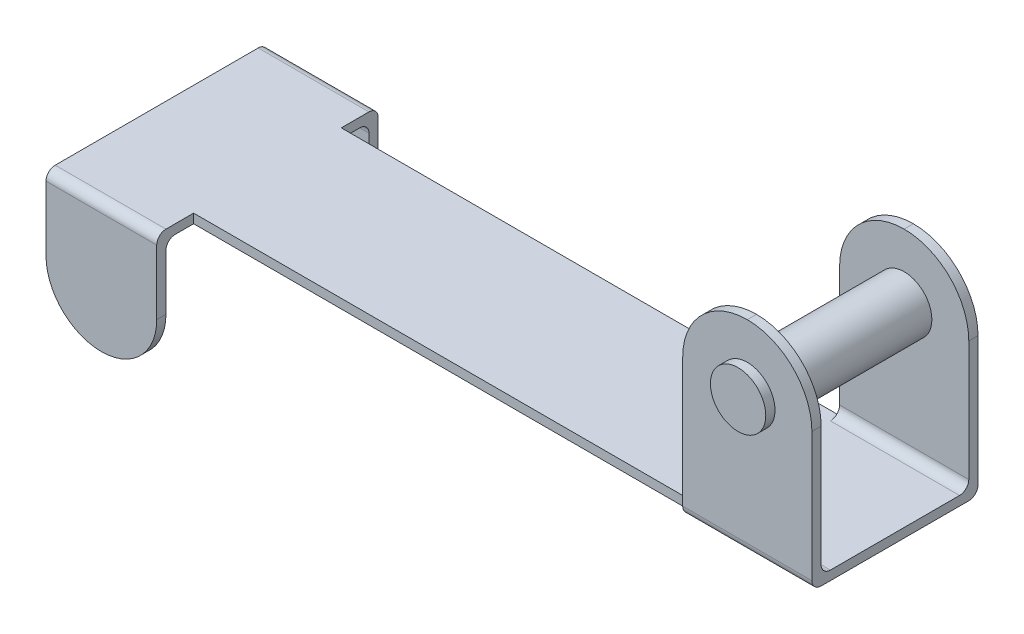
ISO-10303-21;
HEADER;
FILE_DESCRIPTION(('STEP AP214'),'2;1');
FILE_NAME('part.step','',(''),(''),'','','');
FILE_SCHEMA(('AUTOMOTIVE_DESIGN { 1 0 10303 214 1 1 1 1 }'));
ENDSEC;
DATA;
#1=APPLICATION_CONTEXT('core data for automotive mechanical design processes');
#2=APPLICATION_PROTOCOL_DEFINITION('international standard','automotive_design',2000,#1);
#3=PRODUCT_CONTEXT('',#1,'mechanical');
#4=PRODUCT('Part','Part','',(#3));
#5=PRODUCT_RELATED_PRODUCT_CATEGORY('part','',(#4));
#6=PRODUCT_DEFINITION_FORMATION('','',#4);
#7=PRODUCT_DEFINITION_CONTEXT('part definition',#1,'design');
#8=PRODUCT_DEFINITION('design','',#6,#7);
#9=PRODUCT_DEFINITION_SHAPE('','',#8);
#10=(LENGTH_UNIT() NAMED_UNIT(*) SI_UNIT(.MILLI.,.METRE.));
#11=(NAMED_UNIT(*) PLANE_ANGLE_UNIT() SI_UNIT($,.RADIAN.));
#12=(NAMED_UNIT(*) SI_UNIT($,.STERADIAN.) SOLID_ANGLE_UNIT());
#13=UNCERTAINTY_MEASURE_WITH_UNIT(LENGTH_MEASURE(1.E-05),#10,'distance_accuracy_value','');
#14=(GEOMETRIC_REPRESENTATION_CONTEXT(3) GLOBAL_UNCERTAINTY_ASSIGNED_CONTEXT((#13)) GLOBAL_UNIT_ASSIGNED_CONTEXT((#10,
#11,#12)) REPRESENTATION_CONTEXT('',''));
#15=CARTESIAN_POINT('',(0.,0.,0.));
#16=DIRECTION('',(0.,0.,1.));
#17=DIRECTION('',(1.,0.,0.));
#18=AXIS2_PLACEMENT_3D('',#15,#16,#17);
#19=CARTESIAN_POINT('',(0.,0.,2.));
#20=DIRECTION('',(0.,0.,1.));
#21=DIRECTION('',(1.,0.,0.));
#22=AXIS2_PLACEMENT_3D('',#19,#20,#21);
#23=PLANE('',#22);
#24=DIRECTION('',(-1.,0.,0.));
#25=VECTOR('',#24,1.);
#26=CARTESIAN_POINT('',(10.,0.125000000000001,2.));
#27=LINE('',#26,#25);
#28=CARTESIAN_POINT('',(6.5,0.125000000000001,2.));
#29=VERTEX_POINT('',#28);
#30=CARTESIAN_POINT('',(-7.,0.124999999999999,2.));
#31=VERTEX_POINT('',#30);
#32=EDGE_CURVE('E265',#29,#31,#27,.T.);
#33=ORIENTED_EDGE('',*,*,#32,.T.);
#34=DIRECTION('',(0.,-1.,0.));
#35=VECTOR('',#34,1.);
#36=CARTESIAN_POINT('',(-7.,0.124999999999999,2.));
#37=LINE('',#36,#35);
#38=CARTESIAN_POINT('',(-7.,-0.125000000000001,2.));
#39=VERTEX_POINT('',#38);
#40=EDGE_CURVE('E493',#31,#39,#37,.T.);
#41=ORIENTED_EDGE('',*,*,#40,.T.);
#42=DIRECTION('',(1.,0.,0.));
#43=VECTOR('',#42,1.);
#44=CARTESIAN_POINT('',(10.,-0.124999999999999,2.));
#45=LINE('',#44,#43);
#46=CARTESIAN_POINT('',(6.5,-0.124999999999999,2.));
#47=VERTEX_POINT('',#46);
#48=EDGE_CURVE('E263',#39,#47,#45,.T.);
#49=ORIENTED_EDGE('',*,*,#48,.T.);
#50=DIRECTION('',(0.,1.,0.));
#51=VECTOR('',#50,1.);
#52=CARTESIAN_POINT('',(6.5,-0.124999999999999,2.));
#53=LINE('',#52,#51);
#54=EDGE_CURVE('E481',#47,#29,#53,.T.);
#55=ORIENTED_EDGE('',*,*,#54,.T.);
#56=EDGE_LOOP('',(#33,#41,#49,#55));
#57=FACE_BOUND('',#56,.T.);
#58=ADVANCED_FACE('F33',(#57),#23,.T.);
#59=CARTESIAN_POINT('',(-10.,-0.125000000000001,2.));
#60=DIRECTION('',(1.,0.,0.));
#61=DIRECTION('',(0.,0.,-1.));
#62=AXIS2_PLACEMENT_3D('',#59,#60,#61);
#63=PLANE('',#62);
#64=DIRECTION('',(0.,1.,0.));
#65=VECTOR('',#64,1.);
#66=CARTESIAN_POINT('',(-10.,-3.375,3.));
#67=LINE('',#66,#65);
#68=CARTESIAN_POINT('',(-10.,-1.875,3.));
#69=VERTEX_POINT('',#68);
#70=CARTESIAN_POINT('',(-10.,-0.125000000000001,3.));
#71=VERTEX_POINT('',#70);
#72=EDGE_CURVE('E400',#69,#71,#67,.T.);
#73=ORIENTED_EDGE('',*,*,#72,.T.);
#74=CARTESIAN_POINT('',(-10.,-0.125000000000001,2.75));
#75=DIRECTION('',(1.,0.,0.));
#76=DIRECTION('',(0.,0.,-1.));
#77=AXIS2_PLACEMENT_3D('',#74,#75,#76);
#78=CIRCLE('',#77,0.25);
#79=CARTESIAN_POINT('',(-10.,0.124999999999999,2.75));
#80=VERTEX_POINT('',#79);
#81=EDGE_CURVE('E408',#71,#80,#78,.F.);
#82=ORIENTED_EDGE('',*,*,#81,.T.);
#83=DIRECTION('',(0.,0.,-1.));
#84=VECTOR('',#83,1.);
#85=CARTESIAN_POINT('',(-10.,0.124999999999999,2.));
#86=LINE('',#85,#84);
#87=CARTESIAN_POINT('',(-10.,0.124999999999999,-2.75));
#88=VERTEX_POINT('',#87);
#89=EDGE_CURVE('E271',#80,#88,#86,.T.);
#90=ORIENTED_EDGE('',*,*,#89,.T.);
#91=CARTESIAN_POINT('',(-10.,-0.125000000000001,-2.75));
#92=DIRECTION('',(1.,0.,0.));
#93=DIRECTION('',(0.,0.,-1.));
#94=AXIS2_PLACEMENT_3D('',#91,#92,#93);
#95=CIRCLE('',#94,0.25);
#96=CARTESIAN_POINT('',(-10.,-0.125000000000001,-3.));
#97=VERTEX_POINT('',#96);
#98=EDGE_CURVE('E406',#88,#97,#95,.F.);
#99=ORIENTED_EDGE('',*,*,#98,.T.);
#100=DIRECTION('',(0.,-1.,0.));
#101=VECTOR('',#100,1.);
#102=CARTESIAN_POINT('',(-10.,-3.375,-3.));
#103=LINE('',#102,#101);
#104=CARTESIAN_POINT('',(-10.,-1.875,-3.));
#105=VERTEX_POINT('',#104);
#106=EDGE_CURVE('E456',#97,#105,#103,.T.);
#107=ORIENTED_EDGE('',*,*,#106,.T.);
#108=DIRECTION('',(0.,0.,1.));
#109=VECTOR('',#108,1.);
#110=CARTESIAN_POINT('',(-10.,-1.875,-2.75));
#111=LINE('',#110,#109);
#112=CARTESIAN_POINT('',(-10.,-1.875,-2.75));
#113=VERTEX_POINT('',#112);
#114=EDGE_CURVE('E354',#105,#113,#111,.T.);
#115=ORIENTED_EDGE('',*,*,#114,.T.);
#116=DIRECTION('',(0.,1.,0.));
#117=VECTOR('',#116,1.);
#118=CARTESIAN_POINT('',(-10.,-0.124999999999999,-2.75));
#119=LINE('',#118,#117);
#120=CARTESIAN_POINT('',(-10.,-0.375000000000001,-2.75));
#121=VERTEX_POINT('',#120);
#122=EDGE_CURVE('E255',#113,#121,#119,.T.);
#123=ORIENTED_EDGE('',*,*,#122,.T.);
#124=CARTESIAN_POINT('',(-10.,-0.375000000000001,-2.5));
#125=DIRECTION('',(1.,0.,0.));
#126=DIRECTION('',(0.,0.,-1.));
#127=AXIS2_PLACEMENT_3D('',#124,#125,#126);
#128=CIRCLE('',#127,0.25);
#129=CARTESIAN_POINT('',(-10.,-0.125000000000001,-2.5));
#130=VERTEX_POINT('',#129);
#131=EDGE_CURVE('E41',#121,#130,#128,.T.);
#132=ORIENTED_EDGE('',*,*,#131,.T.);
#133=DIRECTION('',(0.,0.,-1.));
#134=VECTOR('',#133,1.);
#135=CARTESIAN_POINT('',(-10.,-0.125000000000001,2.));
#136=LINE('',#135,#134);
#137=CARTESIAN_POINT('',(-10.,-0.125000000000001,2.5));
#138=VERTEX_POINT('',#137);
#139=EDGE_CURVE('E280',#138,#130,#136,.T.);
#140=ORIENTED_EDGE('',*,*,#139,.F.);
#141=CARTESIAN_POINT('',(-10.,-0.375000000000001,2.5));
#142=DIRECTION('',(1.,0.,0.));
#143=DIRECTION('',(0.,0.,-1.));
#144=AXIS2_PLACEMENT_3D('',#141,#142,#143);
#145=CIRCLE('',#144,0.25);
#146=CARTESIAN_POINT('',(-10.,-0.375000000000001,2.75));
#147=VERTEX_POINT('',#146);
#148=EDGE_CURVE('E428',#138,#147,#145,.T.);
#149=ORIENTED_EDGE('',*,*,#148,.T.);
#150=DIRECTION('',(0.,-1.,0.));
#151=VECTOR('',#150,1.);
#152=CARTESIAN_POINT('',(-10.,-0.124999999999999,2.75));
#153=LINE('',#152,#151);
#154=CARTESIAN_POINT('',(-10.,-1.875,2.75));
#155=VERTEX_POINT('',#154);
#156=EDGE_CURVE('E511',#147,#155,#153,.T.);
#157=ORIENTED_EDGE('',*,*,#156,.T.);
#158=DIRECTION('',(0.,0.,1.));
#159=VECTOR('',#158,1.);
#160=CARTESIAN_POINT('',(-10.,-1.875,3.));
#161=LINE('',#160,#159);
#162=EDGE_CURVE('E369',#155,#69,#161,.T.);
#163=ORIENTED_EDGE('',*,*,#162,.T.);
#164=EDGE_LOOP('',(#73,#82,#90,#99,#107,#115,#123,#132,#140,#149,#157,#163));
#165=FACE_BOUND('',#164,.T.);
#166=ADVANCED_FACE('F435',(#165),#63,.F.);
#167=CARTESIAN_POINT('',(10.,-0.124999999999999,2.));
#168=DIRECTION('',(0.,1.,0.));
#169=DIRECTION('',(-1.,0.,0.));
#170=AXIS2_PLACEMENT_3D('',#167,#168,#169);
#171=PLANE('',#170);
#172=DIRECTION('',(0.,0.,1.));
#173=VECTOR('',#172,1.);
#174=CARTESIAN_POINT('',(-7.,-0.124999999999999,2.));
#175=LINE('',#174,#173);
#176=CARTESIAN_POINT('',(-7.,-0.124999999999999,2.5));
#177=VERTEX_POINT('',#176);
#178=EDGE_CURVE('E502',#39,#177,#175,.T.);
#179=ORIENTED_EDGE('',*,*,#178,.T.);
#180=DIRECTION('',(-1.,0.,0.));
#181=VECTOR('',#180,1.);
#182=CARTESIAN_POINT('',(10.,-0.124999999999999,2.5));
#183=LINE('',#182,#181);
#184=EDGE_CURVE('E418',#177,#138,#183,.T.);
#185=ORIENTED_EDGE('',*,*,#184,.T.);
#186=ORIENTED_EDGE('',*,*,#139,.T.);
#187=DIRECTION('',(-1.,0.,0.));
#188=VECTOR('',#187,1.);
#189=CARTESIAN_POINT('',(10.,-0.124999999999999,-2.5));
#190=LINE('',#189,#188);
#191=CARTESIAN_POINT('',(-7.,-0.124999999999999,-2.5));
#192=VERTEX_POINT('',#191);
#193=EDGE_CURVE('E416',#130,#192,#190,.F.);
#194=ORIENTED_EDGE('',*,*,#193,.T.);
#195=DIRECTION('',(0.,0.,1.));
#196=VECTOR('',#195,1.);
#197=CARTESIAN_POINT('',(-7.,-0.124999999999999,-2.));
#198=LINE('',#197,#196);
#199=CARTESIAN_POINT('',(-7.,-0.124999999999999,-2.));
#200=VERTEX_POINT('',#199);
#201=EDGE_CURVE('E450',#192,#200,#198,.T.);
#202=ORIENTED_EDGE('',*,*,#201,.T.);
#203=DIRECTION('',(1.,0.,0.));
#204=VECTOR('',#203,1.);
#205=CARTESIAN_POINT('',(10.,-0.124999999999999,-2.));
#206=LINE('',#205,#204);
#207=CARTESIAN_POINT('',(6.5,-0.124999999999999,-2.));
#208=VERTEX_POINT('',#207);
#209=EDGE_CURVE('E254',#200,#208,#206,.T.);
#210=ORIENTED_EDGE('',*,*,#209,.T.);
#211=DIRECTION('',(1.,0.,0.));
#212=VECTOR('',#211,1.);
#213=CARTESIAN_POINT('',(10.,-0.124999999999999,-2.));
#214=LINE('',#213,#212);
#215=CARTESIAN_POINT('',(10.,-0.124999999999999,-2.));
#216=VERTEX_POINT('',#215);
#217=EDGE_CURVE('E287',#208,#216,#214,.T.);
#218=ORIENTED_EDGE('',*,*,#217,.T.);
#219=DIRECTION('',(0.,0.,-1.));
#220=VECTOR('',#219,1.);
#221=CARTESIAN_POINT('',(10.,-0.124999999999999,2.));
#222=LINE('',#221,#220);
#223=CARTESIAN_POINT('',(10.,-0.124999999999999,2.));
#224=VERTEX_POINT('',#223);
#225=EDGE_CURVE('E277',#224,#216,#222,.T.);
#226=ORIENTED_EDGE('',*,*,#225,.F.);
#227=DIRECTION('',(1.,0.,0.));
#228=VECTOR('',#227,1.);
#229=CARTESIAN_POINT('',(6.5,-0.124999999999999,2.));
#230=LINE('',#229,#228);
#231=EDGE_CURVE('E284',#224,#47,#230,.F.);
#232=ORIENTED_EDGE('',*,*,#231,.T.);
#233=ORIENTED_EDGE('',*,*,#48,.F.);
#234=EDGE_LOOP('',(#179,#185,#186,#194,#202,#210,#218,#226,#232,#233));
#235=FACE_BOUND('',#234,.T.);
#236=ADVANCED_FACE('F442',(#235),#171,.F.);
#237=CARTESIAN_POINT('',(10.,-0.124999999999999,2.));
#238=DIRECTION('',(-1.,0.,0.));
#239=DIRECTION('',(0.,0.,1.));
#240=AXIS2_PLACEMENT_3D('',#237,#238,#239);
#241=PLANE('',#240);
#242=DIRECTION('',(0.,1.,0.));
#243=VECTOR('',#242,1.);
#244=CARTESIAN_POINT('',(10.,-0.124999999999998,-2.25));
#245=LINE('',#244,#243);
#246=CARTESIAN_POINT('',(10.,0.125000000000001,-2.25));
#247=VERTEX_POINT('',#246);
#248=CARTESIAN_POINT('',(10.,3.625,-2.25));
#249=VERTEX_POINT('',#248);
#250=EDGE_CURVE('E474',#247,#249,#245,.T.);
#251=ORIENTED_EDGE('',*,*,#250,.T.);
#252=DIRECTION('',(0.,0.,1.));
#253=VECTOR('',#252,1.);
#254=CARTESIAN_POINT('',(10.,3.625,-2.));
#255=LINE('',#254,#253);
#256=CARTESIAN_POINT('',(10.,3.625,-2.));
#257=VERTEX_POINT('',#256);
#258=EDGE_CURVE('E330',#249,#257,#255,.T.);
#259=ORIENTED_EDGE('',*,*,#258,.T.);
#260=DIRECTION('',(0.,-1.,0.));
#261=VECTOR('',#260,1.);
#262=CARTESIAN_POINT('',(10.,-0.124999999999999,-2.));
#263=LINE('',#262,#261);
#264=CARTESIAN_POINT('',(10.,0.375000000000001,-2.));
#265=VERTEX_POINT('',#264);
#266=EDGE_CURVE('E358',#257,#265,#263,.T.);
#267=ORIENTED_EDGE('',*,*,#266,.T.);
#268=CARTESIAN_POINT('',(10.,0.375000000000001,-1.75));
#269=DIRECTION('',(-1.,0.,0.));
#270=DIRECTION('',(0.,0.,1.));
#271=AXIS2_PLACEMENT_3D('',#268,#269,#270);
#272=CIRCLE('',#271,0.25);
#273=CARTESIAN_POINT('',(10.,0.125000000000001,-1.75));
#274=VERTEX_POINT('',#273);
#275=EDGE_CURVE('E322',#265,#274,#272,.T.);
#276=ORIENTED_EDGE('',*,*,#275,.T.);
#277=DIRECTION('',(0.,0.,-1.));
#278=VECTOR('',#277,1.);
#279=CARTESIAN_POINT('',(10.,0.125000000000001,2.));
#280=LINE('',#279,#278);
#281=CARTESIAN_POINT('',(10.,0.125000000000001,1.75));
#282=VERTEX_POINT('',#281);
#283=EDGE_CURVE('E274',#282,#274,#280,.T.);
#284=ORIENTED_EDGE('',*,*,#283,.F.);
#285=CARTESIAN_POINT('',(10.,0.375000000000001,1.75));
#286=DIRECTION('',(-1.,0.,0.));
#287=DIRECTION('',(0.,0.,1.));
#288=AXIS2_PLACEMENT_3D('',#285,#286,#287);
#289=CIRCLE('',#288,0.25);
#290=CARTESIAN_POINT('',(10.,0.375000000000001,2.));
#291=VERTEX_POINT('',#290);
#292=EDGE_CURVE('E326',#282,#291,#289,.T.);
#293=ORIENTED_EDGE('',*,*,#292,.T.);
#294=DIRECTION('',(0.,1.,0.));
#295=VECTOR('',#294,1.);
#296=CARTESIAN_POINT('',(10.,-0.124999999999999,2.));
#297=LINE('',#296,#295);
#298=CARTESIAN_POINT('',(10.,3.625,2.));
#299=VERTEX_POINT('',#298);
#300=EDGE_CURVE('E477',#291,#299,#297,.T.);
#301=ORIENTED_EDGE('',*,*,#300,.T.);
#302=DIRECTION('',(0.,0.,1.));
#303=VECTOR('',#302,1.);
#304=CARTESIAN_POINT('',(10.,3.625,2.25));
#305=LINE('',#304,#303);
#306=CARTESIAN_POINT('',(10.,3.625,2.25));
#307=VERTEX_POINT('',#306);
#308=EDGE_CURVE('E328',#299,#307,#305,.T.);
#309=ORIENTED_EDGE('',*,*,#308,.T.);
#310=DIRECTION('',(0.,-1.,0.));
#311=VECTOR('',#310,1.);
#312=CARTESIAN_POINT('',(10.,-0.124999999999999,2.25));
#313=LINE('',#312,#311);
#314=CARTESIAN_POINT('',(10.,0.125000000000001,2.25));
#315=VERTEX_POINT('',#314);
#316=EDGE_CURVE('E488',#307,#315,#313,.T.);
#317=ORIENTED_EDGE('',*,*,#316,.T.);
#318=CARTESIAN_POINT('',(10.,0.125000000000001,2.));
#319=DIRECTION('',(-1.,0.,0.));
#320=DIRECTION('',(0.,0.,1.));
#321=AXIS2_PLACEMENT_3D('',#318,#319,#320);
#322=CIRCLE('',#321,0.25);
#323=EDGE_CURVE('E290',#315,#224,#322,.F.);
#324=ORIENTED_EDGE('',*,*,#323,.T.);
#325=ORIENTED_EDGE('',*,*,#225,.T.);
#326=CARTESIAN_POINT('',(10.,0.125000000000001,-2.));
#327=DIRECTION('',(-1.,0.,0.));
#328=DIRECTION('',(0.,0.,1.));
#329=AXIS2_PLACEMENT_3D('',#326,#327,#328);
#330=CIRCLE('',#329,0.25);
#331=EDGE_CURVE('E292',#216,#247,#330,.F.);
#332=ORIENTED_EDGE('',*,*,#331,.T.);
#333=EDGE_LOOP('',(#251,#259,#267,#276,#284,#293,#301,#309,#317,#324,#325,#332));
#334=FACE_BOUND('',#333,.T.);
#335=ADVANCED_FACE('F560',(#334),#241,.F.);
#336=CARTESIAN_POINT('',(10.,0.125000000000001,2.));
#337=DIRECTION('',(0.,-1.,0.));
#338=DIRECTION('',(1.,0.,0.));
#339=AXIS2_PLACEMENT_3D('',#336,#337,#338);
#340=PLANE('',#339);
#341=ORIENTED_EDGE('',*,*,#89,.F.);
#342=DIRECTION('',(-1.,0.,0.));
#343=VECTOR('',#342,1.);
#344=CARTESIAN_POINT('',(-7.,0.124999999999999,2.75));
#345=LINE('',#344,#343);
#346=CARTESIAN_POINT('',(-7.,0.124999999999999,2.75));
#347=VERTEX_POINT('',#346);
#348=EDGE_CURVE('E412',#80,#347,#345,.F.);
#349=ORIENTED_EDGE('',*,*,#348,.T.);
#350=DIRECTION('',(0.,0.,-1.));
#351=VECTOR('',#350,1.);
#352=CARTESIAN_POINT('',(-7.,0.124999999999999,3.));
#353=LINE('',#352,#351);
#354=EDGE_CURVE('E500',#347,#31,#353,.T.);
#355=ORIENTED_EDGE('',*,*,#354,.T.);
#356=ORIENTED_EDGE('',*,*,#32,.F.);
#357=DIRECTION('',(0.,0.,-1.));
#358=VECTOR('',#357,1.);
#359=CARTESIAN_POINT('',(6.5,0.125000000000001,0.));
#360=LINE('',#359,#358);
#361=CARTESIAN_POINT('',(6.5,0.125000000000001,1.75));
#362=VERTEX_POINT('',#361);
#363=EDGE_CURVE('E307',#29,#362,#360,.T.);
#364=ORIENTED_EDGE('',*,*,#363,.T.);
#365=DIRECTION('',(-1.,0.,0.));
#366=VECTOR('',#365,1.);
#367=CARTESIAN_POINT('',(10.,0.125000000000001,1.75));
#368=LINE('',#367,#366);
#369=EDGE_CURVE('E305',#362,#282,#368,.F.);
#370=ORIENTED_EDGE('',*,*,#369,.T.);
#371=ORIENTED_EDGE('',*,*,#283,.T.);
#372=DIRECTION('',(-1.,0.,0.));
#373=VECTOR('',#372,1.);
#374=CARTESIAN_POINT('',(10.,0.125000000000001,-1.75));
#375=LINE('',#374,#373);
#376=CARTESIAN_POINT('',(6.5,0.125000000000001,-1.75));
#377=VERTEX_POINT('',#376);
#378=EDGE_CURVE('E311',#274,#377,#375,.T.);
#379=ORIENTED_EDGE('',*,*,#378,.T.);
#380=DIRECTION('',(0.,0.,-1.));
#381=VECTOR('',#380,1.);
#382=CARTESIAN_POINT('',(6.5,0.125000000000001,2.));
#383=LINE('',#382,#381);
#384=CARTESIAN_POINT('',(6.5,0.125,-2.));
#385=VERTEX_POINT('',#384);
#386=EDGE_CURVE('E261',#377,#385,#383,.T.);
#387=ORIENTED_EDGE('',*,*,#386,.T.);
#388=DIRECTION('',(-1.,0.,0.));
#389=VECTOR('',#388,1.);
#390=CARTESIAN_POINT('',(10.,0.125000000000001,-2.));
#391=LINE('',#390,#389);
#392=CARTESIAN_POINT('',(-7.,0.124999999999999,-2.));
#393=VERTEX_POINT('',#392);
#394=EDGE_CURVE('E253',#385,#393,#391,.T.);
#395=ORIENTED_EDGE('',*,*,#394,.T.);
#396=DIRECTION('',(0.,0.,-1.));
#397=VECTOR('',#396,1.);
#398=CARTESIAN_POINT('',(-7.,0.124999999999999,-3.));
#399=LINE('',#398,#397);
#400=CARTESIAN_POINT('',(-7.,0.124999999999999,-2.75));
#401=VERTEX_POINT('',#400);
#402=EDGE_CURVE('E236',#393,#401,#399,.T.);
#403=ORIENTED_EDGE('',*,*,#402,.T.);
#404=DIRECTION('',(-1.,0.,0.));
#405=VECTOR('',#404,1.);
#406=CARTESIAN_POINT('',(-10.,0.124999999999999,-2.75));
#407=LINE('',#406,#405);
#408=EDGE_CURVE('E410',#401,#88,#407,.T.);
#409=ORIENTED_EDGE('',*,*,#408,.T.);
#410=EDGE_LOOP('',(#341,#349,#355,#356,#364,#370,#371,#379,#387,#395,#403,#409));
#411=FACE_BOUND('',#410,.T.);
#412=ADVANCED_FACE('F258',(#411),#340,.F.);
#413=CARTESIAN_POINT('',(0.,0.,-2.));
#414=DIRECTION('',(0.,0.,1.));
#415=DIRECTION('',(1.,0.,0.));
#416=AXIS2_PLACEMENT_3D('',#413,#414,#415);
#417=PLANE('',#416);
#418=ORIENTED_EDGE('',*,*,#209,.F.);
#419=DIRECTION('',(0.,1.,0.));
#420=VECTOR('',#419,1.);
#421=CARTESIAN_POINT('',(-7.,0.124999999999999,-2.));
#422=LINE('',#421,#420);
#423=EDGE_CURVE('E239',#200,#393,#422,.T.);
#424=ORIENTED_EDGE('',*,*,#423,.T.);
#425=ORIENTED_EDGE('',*,*,#394,.F.);
#426=DIRECTION('',(0.,-1.,0.));
#427=VECTOR('',#426,1.);
#428=CARTESIAN_POINT('',(6.5,-0.124999999999999,-2.));
#429=LINE('',#428,#427);
#430=EDGE_CURVE('E283',#385,#208,#429,.T.);
#431=ORIENTED_EDGE('',*,*,#430,.T.);
#432=EDGE_LOOP('',(#418,#424,#425,#431));
#433=FACE_BOUND('',#432,.T.);
#434=ADVANCED_FACE('F251',(#433),#417,.F.);
#435=CARTESIAN_POINT('',(6.5,-0.124999999999999,2.));
#436=DIRECTION('',(0.,0.,-1.));
#437=DIRECTION('',(-1.,0.,0.));
#438=AXIS2_PLACEMENT_3D('',#435,#436,#437);
#439=PLANE('',#438);
#440=CARTESIAN_POINT('',(8.25,3.625,2.));
#441=DIRECTION('',(0.,0.,-1.));
#442=DIRECTION('',(-1.,0.,0.));
#443=AXIS2_PLACEMENT_3D('',#440,#441,#442);
#444=CIRCLE('',#443,0.75);
#445=CARTESIAN_POINT('',(7.5,3.625,2.));
#446=VERTEX_POINT('',#445);
#447=EDGE_CURVE('E362',#446,#446,#444,.F.);
#448=ORIENTED_EDGE('',*,*,#447,.T.);
#449=EDGE_LOOP('',(#448));
#450=FACE_BOUND('',#449,.T.);
#451=CARTESIAN_POINT('',(6.5,0.375000000000001,2.));
#452=VERTEX_POINT('',#451);
#453=CARTESIAN_POINT('',(6.5,3.625,2.));
#454=VERTEX_POINT('',#453);
#455=EDGE_CURVE('E484',#452,#454,#53,.T.);
#456=ORIENTED_EDGE('',*,*,#455,.T.);
#457=CARTESIAN_POINT('',(8.25,3.625,2.));
#458=DIRECTION('',(0.,0.,-1.));
#459=DIRECTION('',(-1.,0.,0.));
#460=AXIS2_PLACEMENT_3D('',#457,#458,#459);
#461=CIRCLE('',#460,1.75);
#462=CARTESIAN_POINT('',(8.25,5.375,2.));
#463=VERTEX_POINT('',#462);
#464=EDGE_CURVE('E352',#454,#463,#461,.T.);
#465=ORIENTED_EDGE('',*,*,#464,.T.);
#466=CARTESIAN_POINT('',(8.25,3.625,2.));
#467=DIRECTION('',(0.,0.,-1.));
#468=DIRECTION('',(-1.,0.,0.));
#469=AXIS2_PLACEMENT_3D('',#466,#467,#468);
#470=CIRCLE('',#469,1.75);
#471=EDGE_CURVE('E350',#463,#299,#470,.T.);
#472=ORIENTED_EDGE('',*,*,#471,.T.);
#473=ORIENTED_EDGE('',*,*,#300,.F.);
#474=DIRECTION('',(-1.,0.,0.));
#475=VECTOR('',#474,1.);
#476=CARTESIAN_POINT('',(6.5,0.375000000000001,2.));
#477=LINE('',#476,#475);
#478=EDGE_CURVE('E316',#291,#452,#477,.T.);
#479=ORIENTED_EDGE('',*,*,#478,.T.);
#480=EDGE_LOOP('',(#456,#465,#472,#473,#479));
#481=FACE_BOUND('',#480,.T.);
#482=ADVANCED_FACE('F554',(#450,#481),#439,.T.);
#483=CARTESIAN_POINT('',(6.5,-0.124999999999999,2.25));
#484=DIRECTION('',(0.,0.,1.));
#485=DIRECTION('',(1.,0.,0.));
#486=AXIS2_PLACEMENT_3D('',#483,#484,#485);
#487=PLANE('',#486);
#488=CARTESIAN_POINT('',(8.25,3.625,2.25));
#489=DIRECTION('',(0.,0.,1.));
#490=DIRECTION('',(1.,0.,0.));
#491=AXIS2_PLACEMENT_3D('',#488,#489,#490);
#492=CIRCLE('',#491,0.75);
#493=CARTESIAN_POINT('',(9.,3.625,2.25));
#494=VERTEX_POINT('',#493);
#495=EDGE_CURVE('E466',#494,#494,#492,.F.);
#496=ORIENTED_EDGE('',*,*,#495,.T.);
#497=EDGE_LOOP('',(#496));
#498=FACE_BOUND('',#497,.T.);
#499=CARTESIAN_POINT('',(8.25,3.625,2.25));
#500=DIRECTION('',(0.,0.,1.));
#501=DIRECTION('',(1.,0.,0.));
#502=AXIS2_PLACEMENT_3D('',#499,#500,#501);
#503=CIRCLE('',#502,1.75);
#504=CARTESIAN_POINT('',(8.25,5.375,2.25));
#505=VERTEX_POINT('',#504);
#506=EDGE_CURVE('E343',#307,#505,#503,.T.);
#507=ORIENTED_EDGE('',*,*,#506,.T.);
#508=CARTESIAN_POINT('',(8.25,3.625,2.25));
#509=DIRECTION('',(0.,0.,1.));
#510=DIRECTION('',(1.,0.,0.));
#511=AXIS2_PLACEMENT_3D('',#508,#509,#510);
#512=CIRCLE('',#511,1.75);
#513=CARTESIAN_POINT('',(6.5,3.625,2.25));
#514=VERTEX_POINT('',#513);
#515=EDGE_CURVE('E345',#505,#514,#512,.T.);
#516=ORIENTED_EDGE('',*,*,#515,.T.);
#517=DIRECTION('',(0.,-1.,0.));
#518=VECTOR('',#517,1.);
#519=CARTESIAN_POINT('',(6.5,-0.124999999999999,2.25));
#520=LINE('',#519,#518);
#521=CARTESIAN_POINT('',(6.5,0.125000000000001,2.25));
#522=VERTEX_POINT('',#521);
#523=EDGE_CURVE('E267',#514,#522,#520,.T.);
#524=ORIENTED_EDGE('',*,*,#523,.T.);
#525=DIRECTION('',(1.,0.,0.));
#526=VECTOR('',#525,1.);
#527=CARTESIAN_POINT('',(10.,0.125000000000001,2.25));
#528=LINE('',#527,#526);
#529=EDGE_CURVE('E299',#522,#315,#528,.T.);
#530=ORIENTED_EDGE('',*,*,#529,.T.);
#531=ORIENTED_EDGE('',*,*,#316,.F.);
#532=EDGE_LOOP('',(#507,#516,#524,#530,#531));
#533=FACE_BOUND('',#532,.T.);
#534=ADVANCED_FACE('F821',(#498,#533),#487,.T.);
#535=CARTESIAN_POINT('',(6.5,0.,0.));
#536=DIRECTION('',(1.,0.,0.));
#537=DIRECTION('',(0.,0.,-1.));
#538=AXIS2_PLACEMENT_3D('',#535,#536,#537);
#539=PLANE('',#538);
#540=ORIENTED_EDGE('',*,*,#523,.F.);
#541=DIRECTION('',(0.,0.,1.));
#542=VECTOR('',#541,1.);
#543=CARTESIAN_POINT('',(6.5,3.625,2.));
#544=LINE('',#543,#542);
#545=EDGE_CURVE('E347',#514,#454,#544,.F.);
#546=ORIENTED_EDGE('',*,*,#545,.T.);
#547=ORIENTED_EDGE('',*,*,#455,.F.);
#548=CARTESIAN_POINT('',(6.5,0.375000000000001,1.75));
#549=DIRECTION('',(1.,0.,0.));
#550=DIRECTION('',(0.,0.,-1.));
#551=AXIS2_PLACEMENT_3D('',#548,#549,#550);
#552=CIRCLE('',#551,0.25);
#553=EDGE_CURVE('E324',#452,#362,#552,.T.);
#554=ORIENTED_EDGE('',*,*,#553,.T.);
#555=ORIENTED_EDGE('',*,*,#363,.F.);
#556=ORIENTED_EDGE('',*,*,#54,.F.);
#557=CARTESIAN_POINT('',(6.5,0.125000000000001,2.));
#558=DIRECTION('',(1.,0.,0.));
#559=DIRECTION('',(0.,0.,-1.));
#560=AXIS2_PLACEMENT_3D('',#557,#558,#559);
#561=CIRCLE('',#560,0.25);
#562=EDGE_CURVE('E302',#47,#522,#561,.F.);
#563=ORIENTED_EDGE('',*,*,#562,.T.);
#564=EDGE_LOOP('',(#540,#546,#547,#554,#555,#556,#563));
#565=FACE_BOUND('',#564,.T.);
#566=ADVANCED_FACE('F813',(#565),#539,.F.);
#567=CARTESIAN_POINT('',(6.5,-0.124999999999999,-2.));
#568=DIRECTION('',(0.,0.,1.));
#569=DIRECTION('',(1.,0.,0.));
#570=AXIS2_PLACEMENT_3D('',#567,#568,#569);
#571=PLANE('',#570);
#572=CARTESIAN_POINT('',(8.25,3.625,-2.));
#573=DIRECTION('',(0.,0.,1.));
#574=DIRECTION('',(1.,0.,0.));
#575=AXIS2_PLACEMENT_3D('',#572,#573,#574);
#576=CIRCLE('',#575,0.75);
#577=CARTESIAN_POINT('',(9.,3.625,-2.));
#578=VERTEX_POINT('',#577);
#579=EDGE_CURVE('E366',#578,#578,#576,.F.);
#580=ORIENTED_EDGE('',*,*,#579,.T.);
#581=EDGE_LOOP('',(#580));
#582=FACE_BOUND('',#581,.T.);
#583=ORIENTED_EDGE('',*,*,#266,.F.);
#584=CARTESIAN_POINT('',(8.25,3.625,-2.));
#585=DIRECTION('',(0.,0.,1.));
#586=DIRECTION('',(1.,0.,0.));
#587=AXIS2_PLACEMENT_3D('',#584,#585,#586);
#588=CIRCLE('',#587,1.75);
#589=CARTESIAN_POINT('',(8.25,5.375,-2.));
#590=VERTEX_POINT('',#589);
#591=EDGE_CURVE('E335',#257,#590,#588,.T.);
#592=ORIENTED_EDGE('',*,*,#591,.T.);
#593=CARTESIAN_POINT('',(8.25,3.625,-2.));
#594=DIRECTION('',(0.,0.,1.));
#595=DIRECTION('',(1.,0.,0.));
#596=AXIS2_PLACEMENT_3D('',#593,#594,#595);
#597=CIRCLE('',#596,1.75);
#598=CARTESIAN_POINT('',(6.5,3.625,-2.));
#599=VERTEX_POINT('',#598);
#600=EDGE_CURVE('E333',#590,#599,#597,.T.);
#601=ORIENTED_EDGE('',*,*,#600,.T.);
#602=CARTESIAN_POINT('',(6.5,0.375000000000001,-2.));
#603=VERTEX_POINT('',#602);
#604=EDGE_CURVE('E471',#599,#603,#429,.T.);
#605=ORIENTED_EDGE('',*,*,#604,.T.);
#606=DIRECTION('',(-1.,0.,0.));
#607=VECTOR('',#606,1.);
#608=CARTESIAN_POINT('',(6.5,0.375000000000001,-2.));
#609=LINE('',#608,#607);
#610=EDGE_CURVE('E313',#603,#265,#609,.F.);
#611=ORIENTED_EDGE('',*,*,#610,.T.);
#612=EDGE_LOOP('',(#583,#592,#601,#605,#611));
#613=FACE_BOUND('',#612,.T.);
#614=ADVANCED_FACE('F801',(#582,#613),#571,.T.);
#615=CARTESIAN_POINT('',(6.5,-0.124999999999998,-2.25));
#616=DIRECTION('',(0.,0.,-1.));
#617=DIRECTION('',(-1.,0.,0.));
#618=AXIS2_PLACEMENT_3D('',#615,#616,#617);
#619=PLANE('',#618);
#620=CARTESIAN_POINT('',(8.25,3.625,-2.25));
#621=DIRECTION('',(0.,0.,-1.));
#622=DIRECTION('',(-1.,0.,0.));
#623=AXIS2_PLACEMENT_3D('',#620,#621,#622);
#624=CIRCLE('',#623,0.75);
#625=CARTESIAN_POINT('',(7.5,3.625,-2.25));
#626=VERTEX_POINT('',#625);
#627=EDGE_CURVE('E363',#626,#626,#624,.F.);
#628=ORIENTED_EDGE('',*,*,#627,.T.);
#629=EDGE_LOOP('',(#628));
#630=FACE_BOUND('',#629,.T.);
#631=CARTESIAN_POINT('',(8.25,3.625,-2.25));
#632=DIRECTION('',(0.,0.,-1.));
#633=DIRECTION('',(-1.,0.,0.));
#634=AXIS2_PLACEMENT_3D('',#631,#632,#633);
#635=CIRCLE('',#634,1.75);
#636=CARTESIAN_POINT('',(6.5,3.625,-2.25));
#637=VERTEX_POINT('',#636);
#638=CARTESIAN_POINT('',(8.25,5.375,-2.25));
#639=VERTEX_POINT('',#638);
#640=EDGE_CURVE('E337',#637,#639,#635,.T.);
#641=ORIENTED_EDGE('',*,*,#640,.T.);
#642=CARTESIAN_POINT('',(8.25,3.625,-2.25));
#643=DIRECTION('',(0.,0.,-1.));
#644=DIRECTION('',(-1.,0.,0.));
#645=AXIS2_PLACEMENT_3D('',#642,#643,#644);
#646=CIRCLE('',#645,1.75);
#647=EDGE_CURVE('E339',#639,#249,#646,.T.);
#648=ORIENTED_EDGE('',*,*,#647,.T.);
#649=ORIENTED_EDGE('',*,*,#250,.F.);
#650=DIRECTION('',(1.,0.,0.));
#651=VECTOR('',#650,1.);
#652=CARTESIAN_POINT('',(6.5,0.125000000000001,-2.25));
#653=LINE('',#652,#651);
#654=CARTESIAN_POINT('',(6.5,0.125000000000001,-2.25));
#655=VERTEX_POINT('',#654);
#656=EDGE_CURVE('E294',#247,#655,#653,.F.);
#657=ORIENTED_EDGE('',*,*,#656,.T.);
#658=DIRECTION('',(0.,1.,0.));
#659=VECTOR('',#658,1.);
#660=CARTESIAN_POINT('',(6.5,-0.124999999999998,-2.25));
#661=LINE('',#660,#659);
#662=EDGE_CURVE('E473',#655,#637,#661,.T.);
#663=ORIENTED_EDGE('',*,*,#662,.T.);
#664=EDGE_LOOP('',(#641,#648,#649,#657,#663));
#665=FACE_BOUND('',#664,.T.);
#666=ADVANCED_FACE('F796',(#630,#665),#619,.T.);
#667=CARTESIAN_POINT('',(6.5,0.,0.));
#668=DIRECTION('',(-1.,0.,0.));
#669=DIRECTION('',(0.,0.,1.));
#670=AXIS2_PLACEMENT_3D('',#667,#668,#669);
#671=PLANE('',#670);
#672=ORIENTED_EDGE('',*,*,#604,.F.);
#673=DIRECTION('',(0.,0.,1.));
#674=VECTOR('',#673,1.);
#675=CARTESIAN_POINT('',(6.5,3.625,0.));
#676=LINE('',#675,#674);
#677=EDGE_CURVE('E341',#599,#637,#676,.F.);
#678=ORIENTED_EDGE('',*,*,#677,.T.);
#679=ORIENTED_EDGE('',*,*,#662,.F.);
#680=CARTESIAN_POINT('',(6.5,0.125000000000001,-2.));
#681=DIRECTION('',(-1.,0.,0.));
#682=DIRECTION('',(0.,0.,1.));
#683=AXIS2_PLACEMENT_3D('',#680,#681,#682);
#684=CIRCLE('',#683,0.25);
#685=EDGE_CURVE('E296',#655,#208,#684,.T.);
#686=ORIENTED_EDGE('',*,*,#685,.T.);
#687=ORIENTED_EDGE('',*,*,#430,.F.);
#688=ORIENTED_EDGE('',*,*,#386,.F.);
#689=CARTESIAN_POINT('',(6.5,0.375000000000001,-1.75));
#690=DIRECTION('',(-1.,0.,0.));
#691=DIRECTION('',(0.,0.,1.));
#692=AXIS2_PLACEMENT_3D('',#689,#690,#691);
#693=CIRCLE('',#692,0.25);
#694=EDGE_CURVE('E319',#377,#603,#693,.F.);
#695=ORIENTED_EDGE('',*,*,#694,.T.);
#696=EDGE_LOOP('',(#672,#678,#679,#686,#687,#688,#695));
#697=FACE_BOUND('',#696,.T.);
#698=ADVANCED_FACE('F570',(#697),#671,.T.);
#699=CARTESIAN_POINT('',(10.,0.125000000000001,-2.));
#700=DIRECTION('',(-1.,0.,0.));
#701=DIRECTION('',(0.,-1.,0.));
#702=AXIS2_PLACEMENT_3D('',#699,#700,#701);
#703=CYLINDRICAL_SURFACE('',#702,0.25);
#704=ORIENTED_EDGE('',*,*,#685,.F.);
#705=ORIENTED_EDGE('',*,*,#656,.F.);
#706=ORIENTED_EDGE('',*,*,#331,.F.);
#707=ORIENTED_EDGE('',*,*,#217,.F.);
#708=EDGE_LOOP('',(#704,#705,#706,#707));
#709=FACE_BOUND('',#708,.T.);
#710=ADVANCED_FACE('F566',(#709),#703,.T.);
#711=CARTESIAN_POINT('',(6.5,0.125000000000001,2.));
#712=DIRECTION('',(-1.,0.,0.));
#713=DIRECTION('',(0.,-1.,0.));
#714=AXIS2_PLACEMENT_3D('',#711,#712,#713);
#715=CYLINDRICAL_SURFACE('',#714,0.25);
#716=ORIENTED_EDGE('',*,*,#562,.F.);
#717=ORIENTED_EDGE('',*,*,#231,.F.);
#718=ORIENTED_EDGE('',*,*,#323,.F.);
#719=ORIENTED_EDGE('',*,*,#529,.F.);
#720=EDGE_LOOP('',(#716,#717,#718,#719));
#721=FACE_BOUND('',#720,.T.);
#722=ADVANCED_FACE('F569',(#721),#715,.T.);
#723=CARTESIAN_POINT('',(10.,0.375000000000001,-1.75));
#724=DIRECTION('',(-1.,0.,0.));
#725=DIRECTION('',(0.,-1.,0.));
#726=AXIS2_PLACEMENT_3D('',#723,#724,#725);
#727=CYLINDRICAL_SURFACE('',#726,0.25);
#728=ORIENTED_EDGE('',*,*,#275,.F.);
#729=ORIENTED_EDGE('',*,*,#610,.F.);
#730=ORIENTED_EDGE('',*,*,#694,.F.);
#731=ORIENTED_EDGE('',*,*,#378,.F.);
#732=EDGE_LOOP('',(#728,#729,#730,#731));
#733=FACE_BOUND('',#732,.T.);
#734=ADVANCED_FACE('F574',(#733),#727,.F.);
#735=CARTESIAN_POINT('',(6.5,0.375000000000001,1.75));
#736=DIRECTION('',(-1.,0.,0.));
#737=DIRECTION('',(0.,-1.,0.));
#738=AXIS2_PLACEMENT_3D('',#735,#736,#737);
#739=CYLINDRICAL_SURFACE('',#738,0.25);
#740=ORIENTED_EDGE('',*,*,#292,.F.);
#741=ORIENTED_EDGE('',*,*,#369,.F.);
#742=ORIENTED_EDGE('',*,*,#553,.F.);
#743=ORIENTED_EDGE('',*,*,#478,.F.);
#744=EDGE_LOOP('',(#740,#741,#742,#743));
#745=FACE_BOUND('',#744,.T.);
#746=ADVANCED_FACE('F578',(#745),#739,.F.);
#747=CARTESIAN_POINT('',(8.25,3.625,-2.));
#748=DIRECTION('',(0.,0.,1.));
#749=DIRECTION('',(1.,0.,0.));
#750=AXIS2_PLACEMENT_3D('',#747,#748,#749);
#751=CYLINDRICAL_SURFACE('',#750,1.75);
#752=DIRECTION('',(0.,0.,1.));
#753=VECTOR('',#752,1.);
#754=CARTESIAN_POINT('',(8.25,5.375,-2.));
#755=LINE('',#754,#753);
#756=EDGE_CURVE('E355',#639,#590,#755,.T.);
#757=ORIENTED_EDGE('',*,*,#756,.F.);
#758=ORIENTED_EDGE('',*,*,#640,.F.);
#759=ORIENTED_EDGE('',*,*,#677,.F.);
#760=ORIENTED_EDGE('',*,*,#600,.F.);
#761=EDGE_LOOP('',(#757,#758,#759,#760));
#762=FACE_BOUND('',#761,.T.);
#763=ADVANCED_FACE('F582',(#762),#751,.T.);
#764=CARTESIAN_POINT('',(8.25,3.625,2.));
#765=DIRECTION('',(0.,0.,-1.));
#766=DIRECTION('',(-1.,0.,0.));
#767=AXIS2_PLACEMENT_3D('',#764,#765,#766);
#768=CYLINDRICAL_SURFACE('',#767,1.75);
#769=ORIENTED_EDGE('',*,*,#647,.F.);
#770=ORIENTED_EDGE('',*,*,#756,.T.);
#771=ORIENTED_EDGE('',*,*,#591,.F.);
#772=ORIENTED_EDGE('',*,*,#258,.F.);
#773=EDGE_LOOP('',(#769,#770,#771,#772));
#774=FACE_BOUND('',#773,.T.);
#775=ADVANCED_FACE('F584',(#774),#768,.T.);
#776=CARTESIAN_POINT('',(8.25,3.625,2.));
#777=DIRECTION('',(0.,0.,-1.));
#778=DIRECTION('',(-1.,0.,0.));
#779=AXIS2_PLACEMENT_3D('',#776,#777,#778);
#780=CYLINDRICAL_SURFACE('',#779,1.75);
#781=ORIENTED_EDGE('',*,*,#308,.F.);
#782=ORIENTED_EDGE('',*,*,#471,.F.);
#783=DIRECTION('',(0.,0.,1.));
#784=VECTOR('',#783,1.);
#785=CARTESIAN_POINT('',(8.25,5.375,2.));
#786=LINE('',#785,#784);
#787=EDGE_CURVE('E359',#505,#463,#786,.F.);
#788=ORIENTED_EDGE('',*,*,#787,.F.);
#789=ORIENTED_EDGE('',*,*,#506,.F.);
#790=EDGE_LOOP('',(#781,#782,#788,#789));
#791=FACE_BOUND('',#790,.T.);
#792=ADVANCED_FACE('F587',(#791),#780,.T.);
#793=CARTESIAN_POINT('',(8.25,3.625,2.));
#794=DIRECTION('',(0.,0.,-1.));
#795=DIRECTION('',(-1.,0.,0.));
#796=AXIS2_PLACEMENT_3D('',#793,#794,#795);
#797=CYLINDRICAL_SURFACE('',#796,1.75);
#798=ORIENTED_EDGE('',*,*,#464,.F.);
#799=ORIENTED_EDGE('',*,*,#545,.F.);
#800=ORIENTED_EDGE('',*,*,#515,.F.);
#801=ORIENTED_EDGE('',*,*,#787,.T.);
#802=EDGE_LOOP('',(#798,#799,#800,#801));
#803=FACE_BOUND('',#802,.T.);
#804=ADVANCED_FACE('F592',(#803),#797,.T.);
#805=CARTESIAN_POINT('',(8.25,3.625,-2.5));
#806=DIRECTION('',(0.,0.,1.));
#807=DIRECTION('',(1.,0.,0.));
#808=AXIS2_PLACEMENT_3D('',#805,#806,#807);
#809=PLANE('',#808);
#810=CARTESIAN_POINT('',(8.25,3.625,-2.5));
#811=DIRECTION('',(0.,0.,1.));
#812=DIRECTION('',(1.,0.,0.));
#813=AXIS2_PLACEMENT_3D('',#810,#811,#812);
#814=CIRCLE('',#813,0.75);
#815=CARTESIAN_POINT('',(9.,3.625,-2.5));
#816=VERTEX_POINT('',#815);
#817=EDGE_CURVE('E452',#816,#816,#814,.T.);
#818=ORIENTED_EDGE('',*,*,#817,.F.);
#819=EDGE_LOOP('',(#818));
#820=FACE_BOUND('',#819,.T.);
#821=ADVANCED_FACE('F595',(#820),#809,.F.);
#822=CARTESIAN_POINT('',(8.25,3.625,2.5));
#823=DIRECTION('',(0.,0.,-1.));
#824=DIRECTION('',(-1.,0.,0.));
#825=AXIS2_PLACEMENT_3D('',#822,#823,#824);
#826=CYLINDRICAL_SURFACE('',#825,0.75);
#827=ORIENTED_EDGE('',*,*,#627,.F.);
#828=EDGE_LOOP('',(#827));
#829=FACE_BOUND('',#828,.T.);
#830=ORIENTED_EDGE('',*,*,#817,.T.);
#831=EDGE_LOOP('',(#830));
#832=FACE_BOUND('',#831,.T.);
#833=ADVANCED_FACE('F766',(#829,#832),#826,.T.);
#834=ORIENTED_EDGE('',*,*,#447,.F.);
#835=EDGE_LOOP('',(#834));
#836=FACE_BOUND('',#835,.T.);
#837=ORIENTED_EDGE('',*,*,#579,.F.);
#838=EDGE_LOOP('',(#837));
#839=FACE_BOUND('',#838,.T.);
#840=ADVANCED_FACE('F763',(#836,#839),#826,.T.);
#841=ORIENTED_EDGE('',*,*,#495,.F.);
#842=EDGE_LOOP('',(#841));
#843=FACE_BOUND('',#842,.T.);
#844=CARTESIAN_POINT('',(8.25,3.625,2.5));
#845=DIRECTION('',(0.,0.,1.));
#846=DIRECTION('',(1.,0.,0.));
#847=AXIS2_PLACEMENT_3D('',#844,#845,#846);
#848=CIRCLE('',#847,0.75);
#849=CARTESIAN_POINT('',(9.,3.625,2.5));
#850=VERTEX_POINT('',#849);
#851=EDGE_CURVE('E367',#850,#850,#848,.T.);
#852=ORIENTED_EDGE('',*,*,#851,.F.);
#853=EDGE_LOOP('',(#852));
#854=FACE_BOUND('',#853,.T.);
#855=ADVANCED_FACE('F753',(#843,#854),#826,.T.);
#856=CARTESIAN_POINT('',(8.25,3.625,2.5));
#857=DIRECTION('',(0.,0.,1.));
#858=DIRECTION('',(1.,0.,0.));
#859=AXIS2_PLACEMENT_3D('',#856,#857,#858);
#860=PLANE('',#859);
#861=ORIENTED_EDGE('',*,*,#851,.T.);
#862=EDGE_LOOP('',(#861));
#863=FACE_BOUND('',#862,.T.);
#864=ADVANCED_FACE('F692',(#863),#860,.T.);
#865=CARTESIAN_POINT('',(-7.,-0.124999999999999,-2.75));
#866=DIRECTION('',(0.,0.,1.));
#867=DIRECTION('',(0.,-1.,0.));
#868=AXIS2_PLACEMENT_3D('',#865,#866,#867);
#869=PLANE('',#868);
#870=DIRECTION('',(0.,1.,0.));
#871=VECTOR('',#870,1.);
#872=CARTESIAN_POINT('',(-7.,-0.124999999999999,-2.75));
#873=LINE('',#872,#871);
#874=CARTESIAN_POINT('',(-7.,-1.875,-2.75));
#875=VERTEX_POINT('',#874);
#876=CARTESIAN_POINT('',(-7.,-0.375000000000001,-2.75));
#877=VERTEX_POINT('',#876);
#878=EDGE_CURVE('E447',#875,#877,#873,.T.);
#879=ORIENTED_EDGE('',*,*,#878,.T.);
#880=DIRECTION('',(-1.,0.,0.));
#881=VECTOR('',#880,1.);
#882=CARTESIAN_POINT('',(-7.,-0.375000000000001,-2.75));
#883=LINE('',#882,#881);
#884=EDGE_CURVE('E425',#877,#121,#883,.T.);
#885=ORIENTED_EDGE('',*,*,#884,.T.);
#886=ORIENTED_EDGE('',*,*,#122,.F.);
#887=CARTESIAN_POINT('',(-8.5,-1.875,-2.75));
#888=DIRECTION('',(0.,0.,1.));
#889=DIRECTION('',(0.,-1.,0.));
#890=AXIS2_PLACEMENT_3D('',#887,#888,#889);
#891=CIRCLE('',#890,1.5);
#892=CARTESIAN_POINT('',(-8.5,-3.375,-2.75));
#893=VERTEX_POINT('',#892);
#894=EDGE_CURVE('E384',#113,#893,#891,.T.);
#895=ORIENTED_EDGE('',*,*,#894,.T.);
#896=CARTESIAN_POINT('',(-8.5,-1.875,-2.75));
#897=DIRECTION('',(0.,0.,1.));
#898=DIRECTION('',(0.,-1.,0.));
#899=AXIS2_PLACEMENT_3D('',#896,#897,#898);
#900=CIRCLE('',#899,1.5);
#901=EDGE_CURVE('E386',#893,#875,#900,.T.);
#902=ORIENTED_EDGE('',*,*,#901,.T.);
#903=EDGE_LOOP('',(#879,#885,#886,#895,#902));
#904=FACE_BOUND('',#903,.T.);
#905=ADVANCED_FACE('F445',(#904),#869,.T.);
#906=CARTESIAN_POINT('',(-7.,-3.375,-3.));
#907=DIRECTION('',(0.,0.,-1.));
#908=DIRECTION('',(-1.,0.,0.));
#909=AXIS2_PLACEMENT_3D('',#906,#907,#908);
#910=PLANE('',#909);
#911=ORIENTED_EDGE('',*,*,#106,.F.);
#912=DIRECTION('',(-1.,0.,0.));
#913=VECTOR('',#912,1.);
#914=CARTESIAN_POINT('',(-7.,-0.125000000000001,-3.));
#915=LINE('',#914,#913);
#916=CARTESIAN_POINT('',(-7.,-0.125000000000001,-3.));
#917=VERTEX_POINT('',#916);
#918=EDGE_CURVE('E54',#97,#917,#915,.F.);
#919=ORIENTED_EDGE('',*,*,#918,.T.);
#920=DIRECTION('',(0.,-1.,0.));
#921=VECTOR('',#920,1.);
#922=CARTESIAN_POINT('',(-7.,-3.375,-3.));
#923=LINE('',#922,#921);
#924=CARTESIAN_POINT('',(-7.,-1.875,-3.));
#925=VERTEX_POINT('',#924);
#926=EDGE_CURVE('E247',#917,#925,#923,.T.);
#927=ORIENTED_EDGE('',*,*,#926,.T.);
#928=CARTESIAN_POINT('',(-8.5,-1.875,-3.));
#929=DIRECTION('',(0.,0.,-1.));
#930=DIRECTION('',(-1.,0.,0.));
#931=AXIS2_PLACEMENT_3D('',#928,#929,#930);
#932=CIRCLE('',#931,1.5);
#933=CARTESIAN_POINT('',(-8.5,-3.375,-3.));
#934=VERTEX_POINT('',#933);
#935=EDGE_CURVE('E394',#925,#934,#932,.T.);
#936=ORIENTED_EDGE('',*,*,#935,.T.);
#937=CARTESIAN_POINT('',(-8.5,-1.875,-3.));
#938=DIRECTION('',(0.,0.,-1.));
#939=DIRECTION('',(-1.,0.,0.));
#940=AXIS2_PLACEMENT_3D('',#937,#938,#939);
#941=CIRCLE('',#940,1.5);
#942=EDGE_CURVE('E391',#934,#105,#941,.T.);
#943=ORIENTED_EDGE('',*,*,#942,.T.);
#944=EDGE_LOOP('',(#911,#919,#927,#936,#943));
#945=FACE_BOUND('',#944,.T.);
#946=ADVANCED_FACE('F526',(#945),#910,.T.);
#947=CARTESIAN_POINT('',(-7.,0.,0.));
#948=DIRECTION('',(1.,0.,0.));
#949=DIRECTION('',(0.,0.,-1.));
#950=AXIS2_PLACEMENT_3D('',#947,#948,#949);
#951=PLANE('',#950);
#952=ORIENTED_EDGE('',*,*,#926,.F.);
#953=CARTESIAN_POINT('',(-7.,-0.125000000000001,-2.75));
#954=DIRECTION('',(1.,0.,0.));
#955=DIRECTION('',(0.,0.,-1.));
#956=AXIS2_PLACEMENT_3D('',#953,#954,#955);
#957=CIRCLE('',#956,0.25);
#958=EDGE_CURVE('E242',#917,#401,#957,.T.);
#959=ORIENTED_EDGE('',*,*,#958,.T.);
#960=ORIENTED_EDGE('',*,*,#402,.F.);
#961=ORIENTED_EDGE('',*,*,#423,.F.);
#962=ORIENTED_EDGE('',*,*,#201,.F.);
#963=CARTESIAN_POINT('',(-7.,-0.375000000000001,-2.5));
#964=DIRECTION('',(1.,0.,0.));
#965=DIRECTION('',(0.,0.,-1.));
#966=AXIS2_PLACEMENT_3D('',#963,#964,#965);
#967=CIRCLE('',#966,0.25);
#968=EDGE_CURVE('E11',#192,#877,#967,.F.);
#969=ORIENTED_EDGE('',*,*,#968,.T.);
#970=ORIENTED_EDGE('',*,*,#878,.F.);
#971=DIRECTION('',(0.,0.,1.));
#972=VECTOR('',#971,1.);
#973=CARTESIAN_POINT('',(-7.,-1.875,0.));
#974=LINE('',#973,#972);
#975=EDGE_CURVE('E388',#875,#925,#974,.F.);
#976=ORIENTED_EDGE('',*,*,#975,.T.);
#977=EDGE_LOOP('',(#952,#959,#960,#961,#962,#969,#970,#976));
#978=FACE_BOUND('',#977,.T.);
#979=ADVANCED_FACE('F238',(#978),#951,.T.);
#980=CARTESIAN_POINT('',(-7.,-3.375,3.));
#981=DIRECTION('',(0.,0.,1.));
#982=DIRECTION('',(1.,0.,0.));
#983=AXIS2_PLACEMENT_3D('',#980,#981,#982);
#984=PLANE('',#983);
#985=DIRECTION('',(0.,1.,0.));
#986=VECTOR('',#985,1.);
#987=CARTESIAN_POINT('',(-7.,-3.375,3.));
#988=LINE('',#987,#986);
#989=CARTESIAN_POINT('',(-7.,-1.875,3.));
#990=VERTEX_POINT('',#989);
#991=CARTESIAN_POINT('',(-7.,-0.125000000000001,3.));
#992=VERTEX_POINT('',#991);
#993=EDGE_CURVE('E505',#990,#992,#988,.T.);
#994=ORIENTED_EDGE('',*,*,#993,.T.);
#995=DIRECTION('',(-1.,0.,0.));
#996=VECTOR('',#995,1.);
#997=CARTESIAN_POINT('',(-10.,-0.125000000000001,3.));
#998=LINE('',#997,#996);
#999=EDGE_CURVE('E396',#992,#71,#998,.T.);
#1000=ORIENTED_EDGE('',*,*,#999,.T.);
#1001=ORIENTED_EDGE('',*,*,#72,.F.);
#1002=CARTESIAN_POINT('',(-8.5,-1.875,3.));
#1003=DIRECTION('',(0.,0.,1.));
#1004=DIRECTION('',(1.,0.,0.));
#1005=AXIS2_PLACEMENT_3D('',#1002,#1003,#1004);
#1006=CIRCLE('',#1005,1.5);
#1007=CARTESIAN_POINT('',(-8.5,-3.375,3.));
#1008=VERTEX_POINT('',#1007);
#1009=EDGE_CURVE('E374',#69,#1008,#1006,.T.);
#1010=ORIENTED_EDGE('',*,*,#1009,.T.);
#1011=CARTESIAN_POINT('',(-8.5,-1.875,3.));
#1012=DIRECTION('',(0.,0.,1.));
#1013=DIRECTION('',(1.,0.,0.));
#1014=AXIS2_PLACEMENT_3D('',#1011,#1012,#1013);
#1015=CIRCLE('',#1014,1.5);
#1016=EDGE_CURVE('E372',#1008,#990,#1015,.T.);
#1017=ORIENTED_EDGE('',*,*,#1016,.T.);
#1018=EDGE_LOOP('',(#994,#1000,#1001,#1010,#1017));
#1019=FACE_BOUND('',#1018,.T.);
#1020=ADVANCED_FACE('F517',(#1019),#984,.T.);
#1021=CARTESIAN_POINT('',(-7.,-0.124999999999999,2.75));
#1022=DIRECTION('',(0.,0.,-1.));
#1023=DIRECTION('',(0.,1.,0.));
#1024=AXIS2_PLACEMENT_3D('',#1021,#1022,#1023);
#1025=PLANE('',#1024);
#1026=ORIENTED_EDGE('',*,*,#156,.F.);
#1027=DIRECTION('',(-1.,0.,0.));
#1028=VECTOR('',#1027,1.);
#1029=CARTESIAN_POINT('',(-7.,-0.375000000000001,2.75));
#1030=LINE('',#1029,#1028);
#1031=CARTESIAN_POINT('',(-7.,-0.375000000000001,2.75));
#1032=VERTEX_POINT('',#1031);
#1033=EDGE_CURVE('E421',#147,#1032,#1030,.F.);
#1034=ORIENTED_EDGE('',*,*,#1033,.T.);
#1035=DIRECTION('',(0.,-1.,0.));
#1036=VECTOR('',#1035,1.);
#1037=CARTESIAN_POINT('',(-7.,-0.124999999999999,2.75));
#1038=LINE('',#1037,#1036);
#1039=CARTESIAN_POINT('',(-7.,-1.875,2.75));
#1040=VERTEX_POINT('',#1039);
#1041=EDGE_CURVE('E458',#1032,#1040,#1038,.T.);
#1042=ORIENTED_EDGE('',*,*,#1041,.T.);
#1043=CARTESIAN_POINT('',(-8.5,-1.875,2.75));
#1044=DIRECTION('',(0.,0.,-1.));
#1045=DIRECTION('',(0.,1.,0.));
#1046=AXIS2_PLACEMENT_3D('',#1043,#1044,#1045);
#1047=CIRCLE('',#1046,1.5);
#1048=CARTESIAN_POINT('',(-8.5,-3.375,2.75));
#1049=VERTEX_POINT('',#1048);
#1050=EDGE_CURVE('E376',#1040,#1049,#1047,.T.);
#1051=ORIENTED_EDGE('',*,*,#1050,.T.);
#1052=CARTESIAN_POINT('',(-8.5,-1.875,2.75));
#1053=DIRECTION('',(0.,0.,-1.));
#1054=DIRECTION('',(0.,1.,0.));
#1055=AXIS2_PLACEMENT_3D('',#1052,#1053,#1054);
#1056=CIRCLE('',#1055,1.5);
#1057=EDGE_CURVE('E378',#1049,#155,#1056,.T.);
#1058=ORIENTED_EDGE('',*,*,#1057,.T.);
#1059=EDGE_LOOP('',(#1026,#1034,#1042,#1051,#1058));
#1060=FACE_BOUND('',#1059,.T.);
#1061=ADVANCED_FACE('F608',(#1060),#1025,.T.);
#1062=CARTESIAN_POINT('',(-7.,0.,0.));
#1063=DIRECTION('',(-1.,0.,0.));
#1064=DIRECTION('',(0.,0.,1.));
#1065=AXIS2_PLACEMENT_3D('',#1062,#1063,#1064);
#1066=PLANE('',#1065);
#1067=ORIENTED_EDGE('',*,*,#354,.F.);
#1068=CARTESIAN_POINT('',(-7.,-0.125000000000001,2.75));
#1069=DIRECTION('',(-1.,0.,0.));
#1070=DIRECTION('',(0.,0.,1.));
#1071=AXIS2_PLACEMENT_3D('',#1068,#1069,#1070);
#1072=CIRCLE('',#1071,0.25);
#1073=EDGE_CURVE('E414',#347,#992,#1072,.F.);
#1074=ORIENTED_EDGE('',*,*,#1073,.T.);
#1075=ORIENTED_EDGE('',*,*,#993,.F.);
#1076=DIRECTION('',(0.,0.,1.));
#1077=VECTOR('',#1076,1.);
#1078=CARTESIAN_POINT('',(-7.,-1.875,2.75));
#1079=LINE('',#1078,#1077);
#1080=EDGE_CURVE('E381',#990,#1040,#1079,.F.);
#1081=ORIENTED_EDGE('',*,*,#1080,.T.);
#1082=ORIENTED_EDGE('',*,*,#1041,.F.);
#1083=CARTESIAN_POINT('',(-7.,-0.375000000000001,2.5));
#1084=DIRECTION('',(-1.,0.,0.));
#1085=DIRECTION('',(0.,0.,1.));
#1086=AXIS2_PLACEMENT_3D('',#1083,#1084,#1085);
#1087=CIRCLE('',#1086,0.25);
#1088=EDGE_CURVE('E430',#1032,#177,#1087,.T.);
#1089=ORIENTED_EDGE('',*,*,#1088,.T.);
#1090=ORIENTED_EDGE('',*,*,#178,.F.);
#1091=ORIENTED_EDGE('',*,*,#40,.F.);
#1092=EDGE_LOOP('',(#1067,#1074,#1075,#1081,#1082,#1089,#1090,#1091));
#1093=FACE_BOUND('',#1092,.T.);
#1094=ADVANCED_FACE('F499',(#1093),#1066,.F.);
#1095=CARTESIAN_POINT('',(-8.5,-1.875,2.75));
#1096=DIRECTION('',(0.,0.,-1.));
#1097=DIRECTION('',(-1.,0.,0.));
#1098=AXIS2_PLACEMENT_3D('',#1095,#1096,#1097);
#1099=CYLINDRICAL_SURFACE('',#1098,1.5);
#1100=DIRECTION('',(0.,0.,1.));
#1101=VECTOR('',#1100,1.);
#1102=CARTESIAN_POINT('',(-8.5,-3.375,3.));
#1103=LINE('',#1102,#1101);
#1104=EDGE_CURVE('E397',#1049,#1008,#1103,.T.);
#1105=ORIENTED_EDGE('',*,*,#1104,.F.);
#1106=ORIENTED_EDGE('',*,*,#1050,.F.);
#1107=ORIENTED_EDGE('',*,*,#1080,.F.);
#1108=ORIENTED_EDGE('',*,*,#1016,.F.);
#1109=EDGE_LOOP('',(#1105,#1106,#1107,#1108));
#1110=FACE_BOUND('',#1109,.T.);
#1111=ADVANCED_FACE('F601',(#1110),#1099,.T.);
#1112=CARTESIAN_POINT('',(-8.5,-1.875,2.));
#1113=DIRECTION('',(0.,0.,-1.));
#1114=DIRECTION('',(-1.,0.,0.));
#1115=AXIS2_PLACEMENT_3D('',#1112,#1113,#1114);
#1116=CYLINDRICAL_SURFACE('',#1115,1.5);
#1117=ORIENTED_EDGE('',*,*,#1057,.F.);
#1118=ORIENTED_EDGE('',*,*,#1104,.T.);
#1119=ORIENTED_EDGE('',*,*,#1009,.F.);
#1120=ORIENTED_EDGE('',*,*,#162,.F.);
#1121=EDGE_LOOP('',(#1117,#1118,#1119,#1120));
#1122=FACE_BOUND('',#1121,.T.);
#1123=ADVANCED_FACE('F543',(#1122),#1116,.T.);
#1124=CARTESIAN_POINT('',(-8.5,-1.875,2.));
#1125=DIRECTION('',(0.,0.,-1.));
#1126=DIRECTION('',(-1.,0.,0.));
#1127=AXIS2_PLACEMENT_3D('',#1124,#1125,#1126);
#1128=CYLINDRICAL_SURFACE('',#1127,1.5);
#1129=ORIENTED_EDGE('',*,*,#114,.F.);
#1130=ORIENTED_EDGE('',*,*,#942,.F.);
#1131=DIRECTION('',(0.,0.,1.));
#1132=VECTOR('',#1131,1.);
#1133=CARTESIAN_POINT('',(-8.5,-3.375,-3.));
#1134=LINE('',#1133,#1132);
#1135=EDGE_CURVE('E401',#893,#934,#1134,.F.);
#1136=ORIENTED_EDGE('',*,*,#1135,.F.);
#1137=ORIENTED_EDGE('',*,*,#894,.F.);
#1138=EDGE_LOOP('',(#1129,#1130,#1136,#1137));
#1139=FACE_BOUND('',#1138,.T.);
#1140=ADVANCED_FACE('F532',(#1139),#1128,.T.);
#1141=CARTESIAN_POINT('',(-8.5,-1.875,-2.75));
#1142=DIRECTION('',(0.,0.,1.));
#1143=DIRECTION('',(1.,0.,0.));
#1144=AXIS2_PLACEMENT_3D('',#1141,#1142,#1143);
#1145=CYLINDRICAL_SURFACE('',#1144,1.5);
#1146=ORIENTED_EDGE('',*,*,#935,.F.);
#1147=ORIENTED_EDGE('',*,*,#975,.F.);
#1148=ORIENTED_EDGE('',*,*,#901,.F.);
#1149=ORIENTED_EDGE('',*,*,#1135,.T.);
#1150=EDGE_LOOP('',(#1146,#1147,#1148,#1149));
#1151=FACE_BOUND('',#1150,.T.);
#1152=ADVANCED_FACE('F534',(#1151),#1145,.T.);
#1153=CARTESIAN_POINT('',(-7.,-0.125000000000001,2.75));
#1154=DIRECTION('',(1.,0.,0.));
#1155=DIRECTION('',(0.,1.,0.));
#1156=AXIS2_PLACEMENT_3D('',#1153,#1154,#1155);
#1157=CYLINDRICAL_SURFACE('',#1156,0.25);
#1158=ORIENTED_EDGE('',*,*,#1073,.F.);
#1159=ORIENTED_EDGE('',*,*,#348,.F.);
#1160=ORIENTED_EDGE('',*,*,#81,.F.);
#1161=ORIENTED_EDGE('',*,*,#999,.F.);
#1162=EDGE_LOOP('',(#1158,#1159,#1160,#1161));
#1163=FACE_BOUND('',#1162,.T.);
#1164=ADVANCED_FACE('F522',(#1163),#1157,.T.);
#1165=CARTESIAN_POINT('',(10.,-0.374999999999999,2.5));
#1166=DIRECTION('',(-1.,0.,0.));
#1167=DIRECTION('',(0.,-1.,0.));
#1168=AXIS2_PLACEMENT_3D('',#1165,#1166,#1167);
#1169=CYLINDRICAL_SURFACE('',#1168,0.25);
#1170=ORIENTED_EDGE('',*,*,#1088,.F.);
#1171=ORIENTED_EDGE('',*,*,#1033,.F.);
#1172=ORIENTED_EDGE('',*,*,#148,.F.);
#1173=ORIENTED_EDGE('',*,*,#184,.F.);
#1174=EDGE_LOOP('',(#1170,#1171,#1172,#1173));
#1175=FACE_BOUND('',#1174,.T.);
#1176=ADVANCED_FACE('F541',(#1175),#1169,.F.);
#1177=CARTESIAN_POINT('',(10.,-0.124999999999999,-2.75));
#1178=DIRECTION('',(1.,0.,0.));
#1179=DIRECTION('',(0.,1.,0.));
#1180=AXIS2_PLACEMENT_3D('',#1177,#1178,#1179);
#1181=CYLINDRICAL_SURFACE('',#1180,0.25);
#1182=ORIENTED_EDGE('',*,*,#958,.F.);
#1183=ORIENTED_EDGE('',*,*,#918,.F.);
#1184=ORIENTED_EDGE('',*,*,#98,.F.);
#1185=ORIENTED_EDGE('',*,*,#408,.F.);
#1186=EDGE_LOOP('',(#1182,#1183,#1184,#1185));
#1187=FACE_BOUND('',#1186,.T.);
#1188=ADVANCED_FACE('F525',(#1187),#1181,.T.);
#1189=CARTESIAN_POINT('',(-7.,-0.375000000000001,-2.5));
#1190=DIRECTION('',(-1.,0.,0.));
#1191=DIRECTION('',(0.,-1.,0.));
#1192=AXIS2_PLACEMENT_3D('',#1189,#1190,#1191);
#1193=CYLINDRICAL_SURFACE('',#1192,0.25);
#1194=ORIENTED_EDGE('',*,*,#968,.F.);
#1195=ORIENTED_EDGE('',*,*,#193,.F.);
#1196=ORIENTED_EDGE('',*,*,#131,.F.);
#1197=ORIENTED_EDGE('',*,*,#884,.F.);
#1198=EDGE_LOOP('',(#1194,#1195,#1196,#1197));
#1199=FACE_BOUND('',#1198,.T.);
#1200=ADVANCED_FACE('F35',(#1199),#1193,.F.);
#1201=CLOSED_SHELL('',(#58,#166,#236,#335,#412,#434,#482,#534,#566,#614,#666,#698,#710,#722,
#734,#746,#763,#775,#792,#804,#821,#833,#840,#855,#864,#905,#946,#979,#1020,#1061,#1094,#1111,
#1123,#1140,#1152,#1164,#1176,#1188,#1200));
#1202=MANIFOLD_SOLID_BREP('B2',#1201);
#1203=ADVANCED_BREP_SHAPE_REPRESENTATION('',(#18,#1202),#14);
#1204=SHAPE_DEFINITION_REPRESENTATION(#9,#1203);
ENDSEC;
END-ISO-10303-21;
